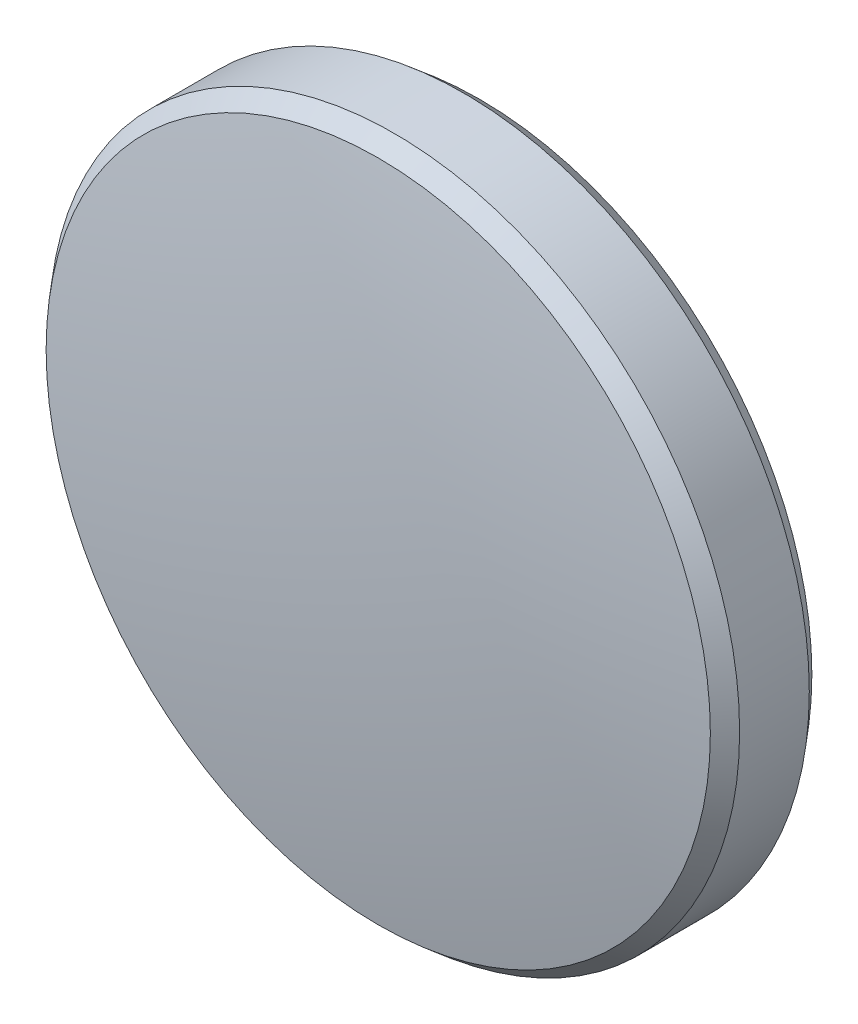
ISO-10303-21;
HEADER;
FILE_DESCRIPTION(('STEP AP214'),'2;1');
FILE_NAME('part.step','',(''),(''),'','','');
FILE_SCHEMA(('AUTOMOTIVE_DESIGN { 1 0 10303 214 1 1 1 1 }'));
ENDSEC;
DATA;
#1=APPLICATION_CONTEXT('core data for automotive mechanical design processes');
#2=APPLICATION_PROTOCOL_DEFINITION('international standard','automotive_design',2000,#1);
#3=PRODUCT_CONTEXT('',#1,'mechanical');
#4=PRODUCT('Part','Part','',(#3));
#5=PRODUCT_RELATED_PRODUCT_CATEGORY('part','',(#4));
#6=PRODUCT_DEFINITION_FORMATION('','',#4);
#7=PRODUCT_DEFINITION_CONTEXT('part definition',#1,'design');
#8=PRODUCT_DEFINITION('design','',#6,#7);
#9=PRODUCT_DEFINITION_SHAPE('','',#8);
#10=(LENGTH_UNIT() NAMED_UNIT(*) SI_UNIT(.MILLI.,.METRE.));
#11=(NAMED_UNIT(*) PLANE_ANGLE_UNIT() SI_UNIT($,.RADIAN.));
#12=(NAMED_UNIT(*) SI_UNIT($,.STERADIAN.) SOLID_ANGLE_UNIT());
#13=UNCERTAINTY_MEASURE_WITH_UNIT(LENGTH_MEASURE(1.E-05),#10,'distance_accuracy_value','');
#14=(GEOMETRIC_REPRESENTATION_CONTEXT(3) GLOBAL_UNCERTAINTY_ASSIGNED_CONTEXT((#13)) GLOBAL_UNIT_ASSIGNED_CONTEXT((#10,
#11,#12)) REPRESENTATION_CONTEXT('',''));
#15=CARTESIAN_POINT('',(0.,0.,0.));
#16=DIRECTION('',(0.,0.,1.));
#17=DIRECTION('',(1.,0.,0.));
#18=AXIS2_PLACEMENT_3D('',#15,#16,#17);
#19=CARTESIAN_POINT('',(0.,0.,-34.85));
#20=DIRECTION('',(0.,0.,1.));
#21=DIRECTION('',(0.,1.,0.));
#22=AXIS2_PLACEMENT_3D('',#19,#20,#21);
#23=SPHERICAL_SURFACE('',#22,36.3);
#24=CARTESIAN_POINT('',(0.,0.,0.932992209179667));
#25=DIRECTION('',(0.,0.,-1.));
#26=DIRECTION('',(-1.,0.,0.));
#27=AXIS2_PLACEMENT_3D('',#24,#25,#26);
#28=CIRCLE('',#27,6.10470872014277);
#29=CARTESIAN_POINT('',(-6.10470872014277,0.,0.932992209179667));
#30=VERTEX_POINT('',#29);
#31=EDGE_CURVE('E9',#30,#30,#28,.F.);
#32=ORIENTED_EDGE('',*,*,#31,.T.);
#33=EDGE_LOOP('',(#32));
#34=FACE_BOUND('',#33,.T.);
#35=ADVANCED_FACE('F13',(#34),#23,.T.);
#36=CARTESIAN_POINT('',(0.,0.,1.45));
#37=DIRECTION('',(0.,0.,1.));
#38=DIRECTION('',(1.,0.,0.));
#39=AXIS2_PLACEMENT_3D('',#36,#37,#38);
#40=CYLINDRICAL_SURFACE('',#39,6.35);
#41=CARTESIAN_POINT('',(0.,0.,-0.640278398468017));
#42=DIRECTION('',(0.,0.,1.));
#43=DIRECTION('',(1.,0.,0.));
#44=AXIS2_PLACEMENT_3D('',#41,#42,#43);
#45=CIRCLE('',#44,6.35);
#46=CARTESIAN_POINT('',(6.35,0.,-0.640278398468017));
#47=VERTEX_POINT('',#46);
#48=EDGE_CURVE('E24',#47,#47,#45,.T.);
#49=ORIENTED_EDGE('',*,*,#48,.T.);
#50=EDGE_LOOP('',(#49));
#51=FACE_BOUND('',#50,.T.);
#52=CARTESIAN_POINT('',(0.,0.,0.640278398468024));
#53=DIRECTION('',(0.,0.,-1.));
#54=DIRECTION('',(-1.,0.,0.));
#55=AXIS2_PLACEMENT_3D('',#52,#53,#54);
#56=CIRCLE('',#55,6.35);
#57=CARTESIAN_POINT('',(-6.35,0.,0.640278398468024));
#58=VERTEX_POINT('',#57);
#59=EDGE_CURVE('E28',#58,#58,#56,.T.);
#60=ORIENTED_EDGE('',*,*,#59,.T.);
#61=EDGE_LOOP('',(#60));
#62=FACE_BOUND('',#61,.T.);
#63=ADVANCED_FACE('F34',(#51,#62),#40,.T.);
#64=CARTESIAN_POINT('',(0.,0.,34.85));
#65=DIRECTION('',(0.,0.,1.));
#66=DIRECTION('',(0.,1.,0.));
#67=AXIS2_PLACEMENT_3D('',#64,#65,#66);
#68=SPHERICAL_SURFACE('',#67,36.3);
#69=CARTESIAN_POINT('',(0.,0.,-0.932992209179667));
#70=DIRECTION('',(0.,0.,1.));
#71=DIRECTION('',(1.,0.,0.));
#72=AXIS2_PLACEMENT_3D('',#69,#70,#71);
#73=CIRCLE('',#72,6.10470872014277);
#74=CARTESIAN_POINT('',(6.10470872014277,0.,-0.932992209179667));
#75=VERTEX_POINT('',#74);
#76=EDGE_CURVE('E20',#75,#75,#73,.F.);
#77=ORIENTED_EDGE('',*,*,#76,.T.);
#78=EDGE_LOOP('',(#77));
#79=FACE_BOUND('',#78,.T.);
#80=ADVANCED_FACE('F43',(#79),#68,.T.);
#81=CARTESIAN_POINT('',(0.,0.,-0.640278398468017));
#82=DIRECTION('',(0.,0.,1.));
#83=DIRECTION('',(1.,0.,0.));
#84=AXIS2_PLACEMENT_3D('',#81,#82,#83);
#85=CONICAL_SURFACE('',#84,6.35,0.69748025407864);
#86=ORIENTED_EDGE('',*,*,#76,.F.);
#87=EDGE_LOOP('',(#86));
#88=FACE_BOUND('',#87,.T.);
#89=ORIENTED_EDGE('',*,*,#48,.F.);
#90=EDGE_LOOP('',(#89));
#91=FACE_BOUND('',#90,.T.);
#92=ADVANCED_FACE('F38',(#88,#91),#85,.T.);
#93=CARTESIAN_POINT('',(0.,0.,0.932992209179667));
#94=DIRECTION('',(0.,0.,-1.));
#95=DIRECTION('',(-1.,0.,0.));
#96=AXIS2_PLACEMENT_3D('',#93,#94,#95);
#97=CONICAL_SURFACE('',#96,6.10470872014277,0.697480254078651);
#98=ORIENTED_EDGE('',*,*,#59,.F.);
#99=EDGE_LOOP('',(#98));
#100=FACE_BOUND('',#99,.T.);
#101=ORIENTED_EDGE('',*,*,#31,.F.);
#102=EDGE_LOOP('',(#101));
#103=FACE_BOUND('',#102,.T.);
#104=ADVANCED_FACE('F15',(#100,#103),#97,.T.);
#105=CLOSED_SHELL('',(#35,#63,#80,#92,#104));
#106=MANIFOLD_SOLID_BREP('B1',#105);
#107=ADVANCED_BREP_SHAPE_REPRESENTATION('',(#18,#106),#14);
#108=SHAPE_DEFINITION_REPRESENTATION(#9,#107);
ENDSEC;
END-ISO-10303-21;
